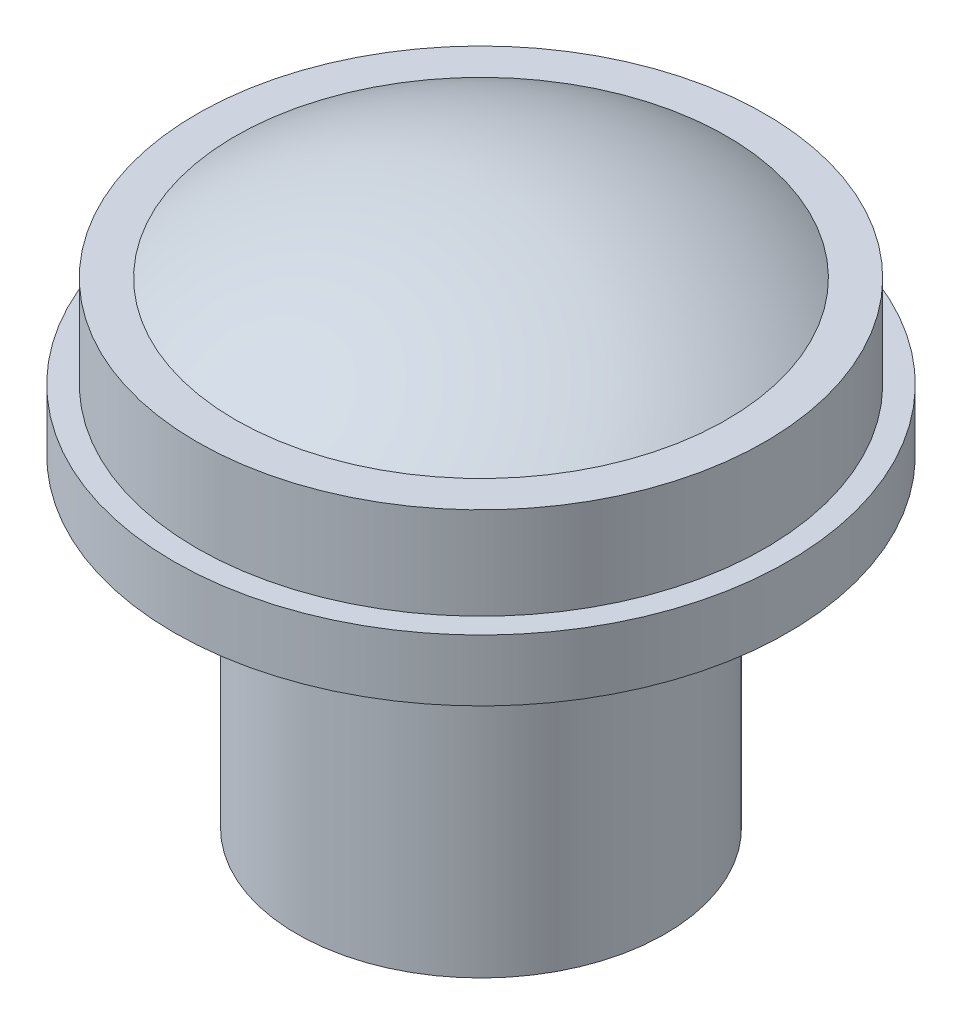
ISO-10303-21;
HEADER;
FILE_DESCRIPTION(('STEP AP214'),'2;1');
FILE_NAME('part.step','',(''),(''),'','','');
FILE_SCHEMA(('AUTOMOTIVE_DESIGN { 1 0 10303 214 1 1 1 1 }'));
ENDSEC;
DATA;
#1=APPLICATION_CONTEXT('core data for automotive mechanical design processes');
#2=APPLICATION_PROTOCOL_DEFINITION('international standard','automotive_design',2000,#1);
#3=PRODUCT_CONTEXT('',#1,'mechanical');
#4=PRODUCT('Part','Part','',(#3));
#5=PRODUCT_RELATED_PRODUCT_CATEGORY('part','',(#4));
#6=PRODUCT_DEFINITION_FORMATION('','',#4);
#7=PRODUCT_DEFINITION_CONTEXT('part definition',#1,'design');
#8=PRODUCT_DEFINITION('design','',#6,#7);
#9=PRODUCT_DEFINITION_SHAPE('','',#8);
#10=(LENGTH_UNIT() NAMED_UNIT(*) SI_UNIT(.MILLI.,.METRE.));
#11=(NAMED_UNIT(*) PLANE_ANGLE_UNIT() SI_UNIT($,.RADIAN.));
#12=(NAMED_UNIT(*) SI_UNIT($,.STERADIAN.) SOLID_ANGLE_UNIT());
#13=UNCERTAINTY_MEASURE_WITH_UNIT(LENGTH_MEASURE(1.E-05),#10,'distance_accuracy_value','');
#14=(GEOMETRIC_REPRESENTATION_CONTEXT(3) GLOBAL_UNCERTAINTY_ASSIGNED_CONTEXT((#13)) GLOBAL_UNIT_ASSIGNED_CONTEXT((#10,
#11,#12)) REPRESENTATION_CONTEXT('',''));
#15=CARTESIAN_POINT('',(0.,0.,0.));
#16=DIRECTION('',(0.,0.,1.));
#17=DIRECTION('',(1.,0.,0.));
#18=AXIS2_PLACEMENT_3D('',#15,#16,#17);
#19=CARTESIAN_POINT('',(0.,12.5,0.));
#20=DIRECTION('',(0.,-1.,0.));
#21=DIRECTION('',(0.,0.,-1.));
#22=AXIS2_PLACEMENT_3D('',#19,#20,#21);
#23=CYLINDRICAL_SURFACE('',#22,9.25);
#24=CARTESIAN_POINT('',(0.,12.5,0.));
#25=DIRECTION('',(0.,1.,0.));
#26=DIRECTION('',(0.,0.,1.));
#27=AXIS2_PLACEMENT_3D('',#24,#25,#26);
#28=CIRCLE('',#27,9.25);
#29=CARTESIAN_POINT('',(0.,12.5,9.25));
#30=VERTEX_POINT('',#29);
#31=EDGE_CURVE('E52',#30,#30,#28,.T.);
#32=ORIENTED_EDGE('',*,*,#31,.T.);
#33=EDGE_LOOP('',(#32));
#34=FACE_BOUND('',#33,.T.);
#35=CARTESIAN_POINT('',(0.,10.5,0.));
#36=DIRECTION('',(0.,1.,0.));
#37=DIRECTION('',(0.,0.,1.));
#38=AXIS2_PLACEMENT_3D('',#35,#36,#37);
#39=CIRCLE('',#38,9.25);
#40=CARTESIAN_POINT('',(0.,10.5,9.25));
#41=VERTEX_POINT('',#40);
#42=EDGE_CURVE('E58',#41,#41,#39,.T.);
#43=ORIENTED_EDGE('',*,*,#42,.F.);
#44=EDGE_LOOP('',(#43));
#45=FACE_BOUND('',#44,.T.);
#46=ADVANCED_FACE('F45',(#34,#45),#23,.F.);
#47=CARTESIAN_POINT('',(0.,12.5,0.));
#48=DIRECTION('',(0.,-1.,0.));
#49=DIRECTION('',(0.,0.,-1.));
#50=AXIS2_PLACEMENT_3D('',#47,#48,#49);
#51=CYLINDRICAL_SURFACE('',#50,10.);
#52=CARTESIAN_POINT('',(0.,12.5,0.));
#53=DIRECTION('',(0.,1.,0.));
#54=DIRECTION('',(0.,0.,1.));
#55=AXIS2_PLACEMENT_3D('',#52,#53,#54);
#56=CIRCLE('',#55,10.);
#57=CARTESIAN_POINT('',(0.,12.5,10.));
#58=VERTEX_POINT('',#57);
#59=EDGE_CURVE('E11',#58,#58,#56,.T.);
#60=ORIENTED_EDGE('',*,*,#59,.F.);
#61=EDGE_LOOP('',(#60));
#62=FACE_BOUND('',#61,.T.);
#63=CARTESIAN_POINT('',(0.,10.5,0.));
#64=DIRECTION('',(0.,1.,0.));
#65=DIRECTION('',(0.,0.,1.));
#66=AXIS2_PLACEMENT_3D('',#63,#64,#65);
#67=CIRCLE('',#66,10.);
#68=CARTESIAN_POINT('',(0.,10.5,10.));
#69=VERTEX_POINT('',#68);
#70=EDGE_CURVE('E48',#69,#69,#67,.T.);
#71=ORIENTED_EDGE('',*,*,#70,.T.);
#72=EDGE_LOOP('',(#71));
#73=FACE_BOUND('',#72,.T.);
#74=ADVANCED_FACE('F65',(#62,#73),#51,.T.);
#75=CARTESIAN_POINT('',(0.,12.5,0.));
#76=DIRECTION('',(0.,1.,0.));
#77=DIRECTION('',(0.,0.,1.));
#78=AXIS2_PLACEMENT_3D('',#75,#76,#77);
#79=PLANE('',#78);
#80=ORIENTED_EDGE('',*,*,#31,.F.);
#81=EDGE_LOOP('',(#80));
#82=FACE_BOUND('',#81,.T.);
#83=ORIENTED_EDGE('',*,*,#59,.T.);
#84=EDGE_LOOP('',(#83));
#85=FACE_BOUND('',#84,.T.);
#86=ADVANCED_FACE('F69',(#82,#85),#79,.T.);
#87=CARTESIAN_POINT('',(0.,10.5,0.));
#88=DIRECTION('',(0.,1.,0.));
#89=DIRECTION('',(0.,0.,1.));
#90=AXIS2_PLACEMENT_3D('',#87,#88,#89);
#91=PLANE('',#90);
#92=ORIENTED_EDGE('',*,*,#42,.T.);
#93=EDGE_LOOP('',(#92));
#94=FACE_BOUND('',#93,.T.);
#95=ORIENTED_EDGE('',*,*,#70,.F.);
#96=EDGE_LOOP('',(#95));
#97=FACE_BOUND('',#96,.T.);
#98=ADVANCED_FACE('F67',(#94,#97),#91,.F.);
#99=CLOSED_SHELL('',(#46,#74,#86,#98));
#100=MANIFOLD_SOLID_BREP('B2',#99);
#101=CARTESIAN_POINT('',(0.,10.4,0.));
#102=DIRECTION('',(0.,1.,0.));
#103=DIRECTION('',(0.,0.,1.));
#104=AXIS2_PLACEMENT_3D('',#101,#102,#103);
#105=CYLINDRICAL_SURFACE('',#104,2.25);
#106=CARTESIAN_POINT('',(0.,10.4,0.));
#107=DIRECTION('',(0.,1.,0.));
#108=DIRECTION('',(0.,0.,1.));
#109=AXIS2_PLACEMENT_3D('',#106,#107,#108);
#110=CIRCLE('',#109,2.25);
#111=CARTESIAN_POINT('',(0.,10.4,2.25));
#112=VERTEX_POINT('',#111);
#113=EDGE_CURVE('E44',#112,#112,#110,.F.);
#114=ORIENTED_EDGE('',*,*,#113,.F.);
#115=EDGE_LOOP('',(#114));
#116=FACE_BOUND('',#115,.T.);
#117=CARTESIAN_POINT('',(0.,10.5,0.));
#118=DIRECTION('',(0.,1.,0.));
#119=DIRECTION('',(0.,0.,1.));
#120=AXIS2_PLACEMENT_3D('',#117,#118,#119);
#121=CIRCLE('',#120,2.25);
#122=CARTESIAN_POINT('',(0.,10.5,2.25));
#123=VERTEX_POINT('',#122);
#124=EDGE_CURVE('E118',#123,#123,#121,.F.);
#125=ORIENTED_EDGE('',*,*,#124,.T.);
#126=EDGE_LOOP('',(#125));
#127=FACE_BOUND('',#126,.T.);
#128=ADVANCED_FACE('F114',(#116,#127),#105,.T.);
#129=CARTESIAN_POINT('',(0.,10.4,0.));
#130=DIRECTION('',(0.,1.,0.));
#131=DIRECTION('',(0.,0.,1.));
#132=AXIS2_PLACEMENT_3D('',#129,#130,#131);
#133=PLANE('',#132);
#134=ORIENTED_EDGE('',*,*,#113,.T.);
#135=EDGE_LOOP('',(#134));
#136=FACE_BOUND('',#135,.T.);
#137=ADVANCED_FACE('F129',(#136),#133,.F.);
#138=CARTESIAN_POINT('',(0.,10.7375,0.));
#139=DIRECTION('',(0.,0.,1.));
#140=DIRECTION('',(1.,0.,0.));
#141=AXIS2_PLACEMENT_3D('',#138,#139,#140);
#142=SPHERICAL_SURFACE('',#141,2.2625);
#143=CARTESIAN_POINT('',(0.,10.7375,0.));
#144=DIRECTION('',(0.,1.,0.));
#145=DIRECTION('',(0.,0.,1.));
#146=AXIS2_PLACEMENT_3D('',#143,#144,#145);
#147=SPHERICAL_SURFACE('',#146,2.2625);
#148=ORIENTED_EDGE('',*,*,#124,.F.);
#149=EDGE_LOOP('',(#148));
#150=FACE_BOUND('',#149,.T.);
#151=ADVANCED_FACE('F116',(#150),#147,.T.);
#152=CLOSED_SHELL('',(#128,#137,#151));
#153=MANIFOLD_SOLID_BREP('B6',#152);
#154=CARTESIAN_POINT('',(0.,15.5,0.));
#155=DIRECTION('',(0.,-1.,0.));
#156=DIRECTION('',(0.,0.,-1.));
#157=AXIS2_PLACEMENT_3D('',#154,#155,#156);
#158=CYLINDRICAL_SURFACE('',#157,8.);
#159=CARTESIAN_POINT('',(0.,15.5,0.));
#160=DIRECTION('',(0.,1.,0.));
#161=DIRECTION('',(0.,0.,1.));
#162=AXIS2_PLACEMENT_3D('',#159,#160,#161);
#163=CIRCLE('',#162,8.);
#164=CARTESIAN_POINT('',(0.,15.5,8.));
#165=VERTEX_POINT('',#164);
#166=EDGE_CURVE('E113',#165,#165,#163,.T.);
#167=ORIENTED_EDGE('',*,*,#166,.F.);
#168=EDGE_LOOP('',(#167));
#169=FACE_BOUND('',#168,.T.);
#170=CARTESIAN_POINT('',(0.,10.5,0.));
#171=DIRECTION('',(0.,1.,0.));
#172=DIRECTION('',(0.,0.,1.));
#173=AXIS2_PLACEMENT_3D('',#170,#171,#172);
#174=CIRCLE('',#173,8.);
#175=CARTESIAN_POINT('',(0.,10.5,8.));
#176=VERTEX_POINT('',#175);
#177=EDGE_CURVE('E172',#176,#176,#174,.T.);
#178=ORIENTED_EDGE('',*,*,#177,.T.);
#179=EDGE_LOOP('',(#178));
#180=FACE_BOUND('',#179,.T.);
#181=ADVANCED_FACE('F165',(#169,#180),#158,.T.);
#182=CARTESIAN_POINT('',(0.,3.95,0.));
#183=DIRECTION('',(0.,0.,1.));
#184=DIRECTION('',(1.,0.,0.));
#185=AXIS2_PLACEMENT_3D('',#182,#183,#184);
#186=SPHERICAL_SURFACE('',#185,14.05);
#187=CARTESIAN_POINT('',(0.,3.95,0.));
#188=DIRECTION('',(0.,1.,0.));
#189=DIRECTION('',(0.,0.,1.));
#190=AXIS2_PLACEMENT_3D('',#187,#188,#189);
#191=SPHERICAL_SURFACE('',#190,14.05);
#192=ORIENTED_EDGE('',*,*,#166,.T.);
#193=EDGE_LOOP('',(#192));
#194=FACE_BOUND('',#193,.T.);
#195=ADVANCED_FACE('F167',(#194),#191,.T.);
#196=CARTESIAN_POINT('',(0.,10.5,0.));
#197=DIRECTION('',(0.,1.,0.));
#198=DIRECTION('',(0.,0.,1.));
#199=AXIS2_PLACEMENT_3D('',#196,#197,#198);
#200=PLANE('',#199);
#201=ORIENTED_EDGE('',*,*,#177,.F.);
#202=EDGE_LOOP('',(#201));
#203=FACE_BOUND('',#202,.T.);
#204=ADVANCED_FACE('F179',(#203),#200,.F.);
#205=CLOSED_SHELL('',(#181,#195,#204));
#206=MANIFOLD_SOLID_BREP('B39',#205);
#207=CARTESIAN_POINT('',(0.,15.5,0.));
#208=DIRECTION('',(0.,-1.,0.));
#209=DIRECTION('',(0.,0.,-1.));
#210=AXIS2_PLACEMENT_3D('',#207,#208,#209);
#211=CYLINDRICAL_SURFACE('',#210,8.);
#212=CARTESIAN_POINT('',(0.,15.5,0.));
#213=DIRECTION('',(0.,1.,0.));
#214=DIRECTION('',(0.,0.,1.));
#215=AXIS2_PLACEMENT_3D('',#212,#213,#214);
#216=CIRCLE('',#215,8.);
#217=CARTESIAN_POINT('',(0.,15.5,8.));
#218=VERTEX_POINT('',#217);
#219=EDGE_CURVE('E219',#218,#218,#216,.T.);
#220=ORIENTED_EDGE('',*,*,#219,.T.);
#221=EDGE_LOOP('',(#220));
#222=FACE_BOUND('',#221,.T.);
#223=CARTESIAN_POINT('',(0.,10.5,0.));
#224=DIRECTION('',(0.,1.,0.));
#225=DIRECTION('',(0.,0.,1.));
#226=AXIS2_PLACEMENT_3D('',#223,#224,#225);
#227=CIRCLE('',#226,8.);
#228=CARTESIAN_POINT('',(0.,10.5,8.));
#229=VERTEX_POINT('',#228);
#230=EDGE_CURVE('E225',#229,#229,#227,.T.);
#231=ORIENTED_EDGE('',*,*,#230,.F.);
#232=EDGE_LOOP('',(#231));
#233=FACE_BOUND('',#232,.T.);
#234=ADVANCED_FACE('F212',(#222,#233),#211,.F.);
#235=CARTESIAN_POINT('',(0.,15.5,0.));
#236=DIRECTION('',(0.,-1.,0.));
#237=DIRECTION('',(0.,0.,-1.));
#238=AXIS2_PLACEMENT_3D('',#235,#236,#237);
#239=CYLINDRICAL_SURFACE('',#238,9.25);
#240=CARTESIAN_POINT('',(0.,15.5,0.));
#241=DIRECTION('',(0.,1.,0.));
#242=DIRECTION('',(0.,0.,1.));
#243=AXIS2_PLACEMENT_3D('',#240,#241,#242);
#244=CIRCLE('',#243,9.25);
#245=CARTESIAN_POINT('',(0.,15.5,9.25));
#246=VERTEX_POINT('',#245);
#247=EDGE_CURVE('E164',#246,#246,#244,.T.);
#248=ORIENTED_EDGE('',*,*,#247,.F.);
#249=EDGE_LOOP('',(#248));
#250=FACE_BOUND('',#249,.T.);
#251=CARTESIAN_POINT('',(0.,10.5,0.));
#252=DIRECTION('',(0.,1.,0.));
#253=DIRECTION('',(0.,0.,1.));
#254=AXIS2_PLACEMENT_3D('',#251,#252,#253);
#255=CIRCLE('',#254,9.25);
#256=CARTESIAN_POINT('',(0.,10.5,9.25));
#257=VERTEX_POINT('',#256);
#258=EDGE_CURVE('E215',#257,#257,#255,.T.);
#259=ORIENTED_EDGE('',*,*,#258,.T.);
#260=EDGE_LOOP('',(#259));
#261=FACE_BOUND('',#260,.T.);
#262=ADVANCED_FACE('F232',(#250,#261),#239,.T.);
#263=CARTESIAN_POINT('',(0.,15.5,0.));
#264=DIRECTION('',(0.,1.,0.));
#265=DIRECTION('',(0.,0.,1.));
#266=AXIS2_PLACEMENT_3D('',#263,#264,#265);
#267=PLANE('',#266);
#268=ORIENTED_EDGE('',*,*,#219,.F.);
#269=EDGE_LOOP('',(#268));
#270=FACE_BOUND('',#269,.T.);
#271=ORIENTED_EDGE('',*,*,#247,.T.);
#272=EDGE_LOOP('',(#271));
#273=FACE_BOUND('',#272,.T.);
#274=ADVANCED_FACE('F236',(#270,#273),#267,.T.);
#275=CARTESIAN_POINT('',(0.,10.5,0.));
#276=DIRECTION('',(0.,1.,0.));
#277=DIRECTION('',(0.,0.,1.));
#278=AXIS2_PLACEMENT_3D('',#275,#276,#277);
#279=PLANE('',#278);
#280=ORIENTED_EDGE('',*,*,#230,.T.);
#281=EDGE_LOOP('',(#280));
#282=FACE_BOUND('',#281,.T.);
#283=ORIENTED_EDGE('',*,*,#258,.F.);
#284=EDGE_LOOP('',(#283));
#285=FACE_BOUND('',#284,.T.);
#286=ADVANCED_FACE('F234',(#282,#285),#279,.F.);
#287=CLOSED_SHELL('',(#234,#262,#274,#286));
#288=MANIFOLD_SOLID_BREP('B108',#287);
#289=CARTESIAN_POINT('',(0.,10.5,0.));
#290=DIRECTION('',(0.,1.,0.));
#291=DIRECTION('',(0.,0.,1.));
#292=AXIS2_PLACEMENT_3D('',#289,#290,#291);
#293=PLANE('',#292);
#294=CARTESIAN_POINT('',(0.,10.5,0.));
#295=DIRECTION('',(0.,1.,0.));
#296=DIRECTION('',(0.,0.,1.));
#297=AXIS2_PLACEMENT_3D('',#294,#295,#296);
#298=CIRCLE('',#297,6.);
#299=CARTESIAN_POINT('',(0.,10.5,-6.));
#300=VERTEX_POINT('',#299);
#301=EDGE_CURVE('E211',#300,#300,#298,.T.);
#302=ORIENTED_EDGE('',*,*,#301,.T.);
#303=EDGE_LOOP('',(#302));
#304=FACE_BOUND('',#303,.T.);
#305=CARTESIAN_POINT('',(0.,10.5,0.));
#306=DIRECTION('',(0.,1.,0.));
#307=DIRECTION('',(0.,0.,1.));
#308=AXIS2_PLACEMENT_3D('',#305,#306,#307);
#309=CIRCLE('',#308,2.25);
#310=CARTESIAN_POINT('',(0.,10.5,-2.25));
#311=VERTEX_POINT('',#310);
#312=EDGE_CURVE('E284',#311,#311,#309,.T.);
#313=ORIENTED_EDGE('',*,*,#312,.F.);
#314=EDGE_LOOP('',(#313));
#315=FACE_BOUND('',#314,.T.);
#316=ADVANCED_FACE('F273',(#304,#315),#293,.T.);
#317=CARTESIAN_POINT('',(0.,0.,0.));
#318=DIRECTION('',(0.,1.,0.));
#319=DIRECTION('',(0.,0.,1.));
#320=AXIS2_PLACEMENT_3D('',#317,#318,#319);
#321=PLANE('',#320);
#322=CARTESIAN_POINT('',(0.,0.,0.));
#323=DIRECTION('',(0.,1.,0.));
#324=DIRECTION('',(0.,0.,1.));
#325=AXIS2_PLACEMENT_3D('',#322,#323,#324);
#326=CIRCLE('',#325,6.);
#327=CARTESIAN_POINT('',(0.,0.,-6.));
#328=VERTEX_POINT('',#327);
#329=EDGE_CURVE('E277',#328,#328,#326,.T.);
#330=ORIENTED_EDGE('',*,*,#329,.F.);
#331=EDGE_LOOP('',(#330));
#332=FACE_BOUND('',#331,.T.);
#333=CARTESIAN_POINT('',(0.,0.,0.));
#334=DIRECTION('',(0.,1.,0.));
#335=DIRECTION('',(0.,0.,1.));
#336=AXIS2_PLACEMENT_3D('',#333,#334,#335);
#337=CIRCLE('',#336,2.25);
#338=CARTESIAN_POINT('',(0.,0.,-2.25));
#339=VERTEX_POINT('',#338);
#340=EDGE_CURVE('E286',#339,#339,#337,.T.);
#341=ORIENTED_EDGE('',*,*,#340,.T.);
#342=EDGE_LOOP('',(#341));
#343=FACE_BOUND('',#342,.T.);
#344=ADVANCED_FACE('F296',(#332,#343),#321,.F.);
#345=CARTESIAN_POINT('',(0.,10.5,0.));
#346=DIRECTION('',(0.,-1.,0.));
#347=DIRECTION('',(0.,0.,-1.));
#348=AXIS2_PLACEMENT_3D('',#345,#346,#347);
#349=CYLINDRICAL_SURFACE('',#348,6.);
#350=CARTESIAN_POINT('',(0.,10.5,-6.));
#351=CARTESIAN_POINT('',(0.,10.390625,-6.));
#352=CARTESIAN_POINT('',(0.,10.28125,-6.));
#353=CARTESIAN_POINT('',(0.,10.0625,-6.));
#354=CARTESIAN_POINT('',(0.,9.953125,-6.));
#355=CARTESIAN_POINT('',(0.,9.734375,-6.));
#356=CARTESIAN_POINT('',(0.,9.625,-6.));
#357=CARTESIAN_POINT('',(0.,9.40625,-6.));
#358=CARTESIAN_POINT('',(0.,9.296875,-6.));
#359=CARTESIAN_POINT('',(0.,9.078125,-6.));
#360=CARTESIAN_POINT('',(0.,8.96875,-6.));
#361=CARTESIAN_POINT('',(0.,8.75,-6.));
#362=CARTESIAN_POINT('',(0.,8.640625,-6.));
#363=CARTESIAN_POINT('',(0.,8.421875,-6.));
#364=CARTESIAN_POINT('',(0.,8.3125,-6.));
#365=CARTESIAN_POINT('',(0.,8.09375,-6.));
#366=CARTESIAN_POINT('',(0.,7.984375,-6.));
#367=CARTESIAN_POINT('',(0.,7.765625,-6.));
#368=CARTESIAN_POINT('',(0.,7.65625,-6.));
#369=CARTESIAN_POINT('',(0.,7.4375,-6.));
#370=CARTESIAN_POINT('',(0.,7.328125,-6.));
#371=CARTESIAN_POINT('',(0.,7.109375,-6.));
#372=CARTESIAN_POINT('',(0.,7.,-6.));
#373=CARTESIAN_POINT('',(0.,6.78125,-6.));
#374=CARTESIAN_POINT('',(0.,6.671875,-6.));
#375=CARTESIAN_POINT('',(0.,6.453125,-6.));
#376=CARTESIAN_POINT('',(0.,6.34375,-6.));
#377=CARTESIAN_POINT('',(0.,6.125,-6.));
#378=CARTESIAN_POINT('',(0.,6.015625,-6.));
#379=CARTESIAN_POINT('',(0.,5.796875,-6.));
#380=CARTESIAN_POINT('',(0.,5.6875,-6.));
#381=CARTESIAN_POINT('',(0.,5.46875,-6.));
#382=CARTESIAN_POINT('',(0.,5.359375,-6.));
#383=CARTESIAN_POINT('',(0.,5.140625,-6.));
#384=CARTESIAN_POINT('',(0.,5.03125,-6.));
#385=CARTESIAN_POINT('',(0.,4.8125,-6.));
#386=CARTESIAN_POINT('',(0.,4.703125,-6.));
#387=CARTESIAN_POINT('',(0.,4.484375,-6.));
#388=CARTESIAN_POINT('',(0.,4.375,-6.));
#389=CARTESIAN_POINT('',(0.,4.15625,-6.));
#390=CARTESIAN_POINT('',(0.,4.046875,-6.));
#391=CARTESIAN_POINT('',(0.,3.828125,-6.));
#392=CARTESIAN_POINT('',(0.,3.71875,-6.));
#393=CARTESIAN_POINT('',(0.,3.5,-6.));
#394=CARTESIAN_POINT('',(0.,3.390625,-6.));
#395=CARTESIAN_POINT('',(0.,3.171875,-6.));
#396=CARTESIAN_POINT('',(0.,3.0625,-6.));
#397=CARTESIAN_POINT('',(0.,2.84375,-6.));
#398=CARTESIAN_POINT('',(0.,2.734375,-6.));
#399=CARTESIAN_POINT('',(0.,2.515625,-6.));
#400=CARTESIAN_POINT('',(0.,2.40625,-6.));
#401=CARTESIAN_POINT('',(0.,2.1875,-6.));
#402=CARTESIAN_POINT('',(0.,2.078125,-6.));
#403=CARTESIAN_POINT('',(0.,1.859375,-6.));
#404=CARTESIAN_POINT('',(0.,1.75,-6.));
#405=CARTESIAN_POINT('',(0.,1.53125,-6.));
#406=CARTESIAN_POINT('',(0.,1.421875,-6.));
#407=CARTESIAN_POINT('',(0.,1.203125,-6.));
#408=CARTESIAN_POINT('',(0.,1.09375,-6.));
#409=CARTESIAN_POINT('',(0.,0.875000000000001,-6.));
#410=CARTESIAN_POINT('',(0.,0.765625000000001,-6.));
#411=CARTESIAN_POINT('',(0.,0.546875,-6.));
#412=CARTESIAN_POINT('',(0.,0.4375,-6.));
#413=CARTESIAN_POINT('',(0.,0.21875,-6.));
#414=CARTESIAN_POINT('',(0.,0.109375,-6.));
#415=CARTESIAN_POINT('',(0.,0.,-6.));
#416=B_SPLINE_CURVE_WITH_KNOTS('',3,(#350,#351,#352,#353,#354,#355,#356,#357,#358,#359,#360,
#361,#362,#363,#364,#365,#366,#367,#368,#369,#370,#371,#372,#373,#374,#375,#376,#377,#378,#379,
#380,#381,#382,#383,#384,#385,#386,#387,#388,#389,#390,#391,#392,#393,#394,#395,#396,#397,#398,
#399,#400,#401,#402,#403,#404,#405,#406,#407,#408,#409,#410,#411,#412,#413,#414,#415),
.UNSPECIFIED.,.F.,.F.,(4,2,2,2,2,2,2,2,2,2,2,2,2,2,2,2,2,2,2,2,2,2,2,2,2,2,2,2,2,2,2,2,4),(0.,
0.328124999999999,0.656249999999999,0.984374999999999,1.3125,1.640625,1.96875,2.296875,2.625,
2.953125,3.28125,3.609375,3.9375,4.265625,4.59375,4.921875,5.25,5.578125,5.90625,6.234375,
6.5625,6.890625,7.21875,7.546875,7.875,8.203125,8.53125,8.859375,9.1875,9.515625,9.84375,
10.171875,10.5),.UNSPECIFIED.);
#417=EDGE_CURVE('BSEAM275',#300,#328,#416,.T.);
#418=ORIENTED_EDGE('',*,*,#301,.F.);
#419=ORIENTED_EDGE('',*,*,#329,.T.);
#420=ORIENTED_EDGE('',*,*,#417,.T.);
#421=ORIENTED_EDGE('',*,*,#417,.F.);
#422=EDGE_LOOP('',(#418,#420,#419,#421));
#423=FACE_BOUND('',#422,.T.);
#424=ADVANCED_FACE('F275',(#423),#349,.T.);
#425=CARTESIAN_POINT('',(0.,10.5,0.));
#426=DIRECTION('',(0.,-1.,0.));
#427=DIRECTION('',(0.,0.,-1.));
#428=AXIS2_PLACEMENT_3D('',#425,#426,#427);
#429=CYLINDRICAL_SURFACE('',#428,2.25);
#430=CARTESIAN_POINT('',(0.,10.5,-2.25));
#431=CARTESIAN_POINT('',(0.,10.390625,-2.25));
#432=CARTESIAN_POINT('',(0.,10.28125,-2.25));
#433=CARTESIAN_POINT('',(0.,10.0625,-2.25));
#434=CARTESIAN_POINT('',(0.,9.953125,-2.25));
#435=CARTESIAN_POINT('',(0.,9.734375,-2.25));
#436=CARTESIAN_POINT('',(0.,9.625,-2.25));
#437=CARTESIAN_POINT('',(0.,9.40625,-2.25));
#438=CARTESIAN_POINT('',(0.,9.296875,-2.25));
#439=CARTESIAN_POINT('',(0.,9.078125,-2.25));
#440=CARTESIAN_POINT('',(0.,8.96875,-2.25));
#441=CARTESIAN_POINT('',(0.,8.75,-2.25));
#442=CARTESIAN_POINT('',(0.,8.640625,-2.25));
#443=CARTESIAN_POINT('',(0.,8.421875,-2.25));
#444=CARTESIAN_POINT('',(0.,8.3125,-2.25));
#445=CARTESIAN_POINT('',(0.,8.09375,-2.25));
#446=CARTESIAN_POINT('',(0.,7.984375,-2.25));
#447=CARTESIAN_POINT('',(0.,7.765625,-2.25));
#448=CARTESIAN_POINT('',(0.,7.65625,-2.25));
#449=CARTESIAN_POINT('',(0.,7.4375,-2.25));
#450=CARTESIAN_POINT('',(0.,7.328125,-2.25));
#451=CARTESIAN_POINT('',(0.,7.109375,-2.25));
#452=CARTESIAN_POINT('',(0.,7.,-2.25));
#453=CARTESIAN_POINT('',(0.,6.78125,-2.25));
#454=CARTESIAN_POINT('',(0.,6.671875,-2.25));
#455=CARTESIAN_POINT('',(0.,6.453125,-2.25));
#456=CARTESIAN_POINT('',(0.,6.34375,-2.25));
#457=CARTESIAN_POINT('',(0.,6.125,-2.25));
#458=CARTESIAN_POINT('',(0.,6.015625,-2.25));
#459=CARTESIAN_POINT('',(0.,5.796875,-2.25));
#460=CARTESIAN_POINT('',(0.,5.6875,-2.25));
#461=CARTESIAN_POINT('',(0.,5.46875,-2.25));
#462=CARTESIAN_POINT('',(0.,5.359375,-2.25));
#463=CARTESIAN_POINT('',(0.,5.140625,-2.25));
#464=CARTESIAN_POINT('',(0.,5.03125,-2.25));
#465=CARTESIAN_POINT('',(0.,4.8125,-2.25));
#466=CARTESIAN_POINT('',(0.,4.703125,-2.25));
#467=CARTESIAN_POINT('',(0.,4.484375,-2.25));
#468=CARTESIAN_POINT('',(0.,4.375,-2.25));
#469=CARTESIAN_POINT('',(0.,4.15625,-2.25));
#470=CARTESIAN_POINT('',(0.,4.046875,-2.25));
#471=CARTESIAN_POINT('',(0.,3.828125,-2.25));
#472=CARTESIAN_POINT('',(0.,3.71875,-2.25));
#473=CARTESIAN_POINT('',(0.,3.5,-2.25));
#474=CARTESIAN_POINT('',(0.,3.390625,-2.25));
#475=CARTESIAN_POINT('',(0.,3.171875,-2.25));
#476=CARTESIAN_POINT('',(0.,3.0625,-2.25));
#477=CARTESIAN_POINT('',(0.,2.84375,-2.25));
#478=CARTESIAN_POINT('',(0.,2.734375,-2.25));
#479=CARTESIAN_POINT('',(0.,2.515625,-2.25));
#480=CARTESIAN_POINT('',(0.,2.40625,-2.25));
#481=CARTESIAN_POINT('',(0.,2.1875,-2.25));
#482=CARTESIAN_POINT('',(0.,2.078125,-2.25));
#483=CARTESIAN_POINT('',(0.,1.859375,-2.25));
#484=CARTESIAN_POINT('',(0.,1.75,-2.25));
#485=CARTESIAN_POINT('',(0.,1.53125,-2.25));
#486=CARTESIAN_POINT('',(0.,1.421875,-2.25));
#487=CARTESIAN_POINT('',(0.,1.203125,-2.25));
#488=CARTESIAN_POINT('',(0.,1.09375,-2.25));
#489=CARTESIAN_POINT('',(0.,0.875000000000001,-2.25));
#490=CARTESIAN_POINT('',(0.,0.765625000000001,-2.25));
#491=CARTESIAN_POINT('',(0.,0.546875,-2.25));
#492=CARTESIAN_POINT('',(0.,0.4375,-2.25));
#493=CARTESIAN_POINT('',(0.,0.21875,-2.25));
#494=CARTESIAN_POINT('',(0.,0.109375,-2.25));
#495=CARTESIAN_POINT('',(0.,0.,-2.25));
#496=B_SPLINE_CURVE_WITH_KNOTS('',3,(#430,#431,#432,#433,#434,#435,#436,#437,#438,#439,#440,
#441,#442,#443,#444,#445,#446,#447,#448,#449,#450,#451,#452,#453,#454,#455,#456,#457,#458,#459,
#460,#461,#462,#463,#464,#465,#466,#467,#468,#469,#470,#471,#472,#473,#474,#475,#476,#477,#478,
#479,#480,#481,#482,#483,#484,#485,#486,#487,#488,#489,#490,#491,#492,#493,#494,#495),
.UNSPECIFIED.,.F.,.F.,(4,2,2,2,2,2,2,2,2,2,2,2,2,2,2,2,2,2,2,2,2,2,2,2,2,2,2,2,2,2,2,2,4),(0.,
0.328125,0.656250000000001,0.984375000000001,1.3125,1.640625,1.96875,2.296875,2.625,2.953125,
3.28125,3.609375,3.9375,4.265625,4.59375,4.921875,5.25,5.578125,5.90625,6.234375,6.5625,
6.890625,7.21875,7.546875,7.875,8.203125,8.53125,8.859375,9.1875,9.515625,9.84375,10.171875,
10.5),.UNSPECIFIED.);
#497=EDGE_CURVE('BSEAM292',#311,#339,#496,.T.);
#498=ORIENTED_EDGE('',*,*,#312,.T.);
#499=ORIENTED_EDGE('',*,*,#340,.F.);
#500=ORIENTED_EDGE('',*,*,#497,.T.);
#501=ORIENTED_EDGE('',*,*,#497,.F.);
#502=EDGE_LOOP('',(#498,#500,#499,#501));
#503=FACE_BOUND('',#502,.T.);
#504=ADVANCED_FACE('F292',(#503),#429,.F.);
#505=CLOSED_SHELL('',(#316,#344,#424,#504));
#506=MANIFOLD_SOLID_BREP('B159',#505);
#507=ADVANCED_BREP_SHAPE_REPRESENTATION('',(#18,#100,#153,#206,#288,#506),#14);
#508=SHAPE_DEFINITION_REPRESENTATION(#9,#507);
ENDSEC;
END-ISO-10303-21;
